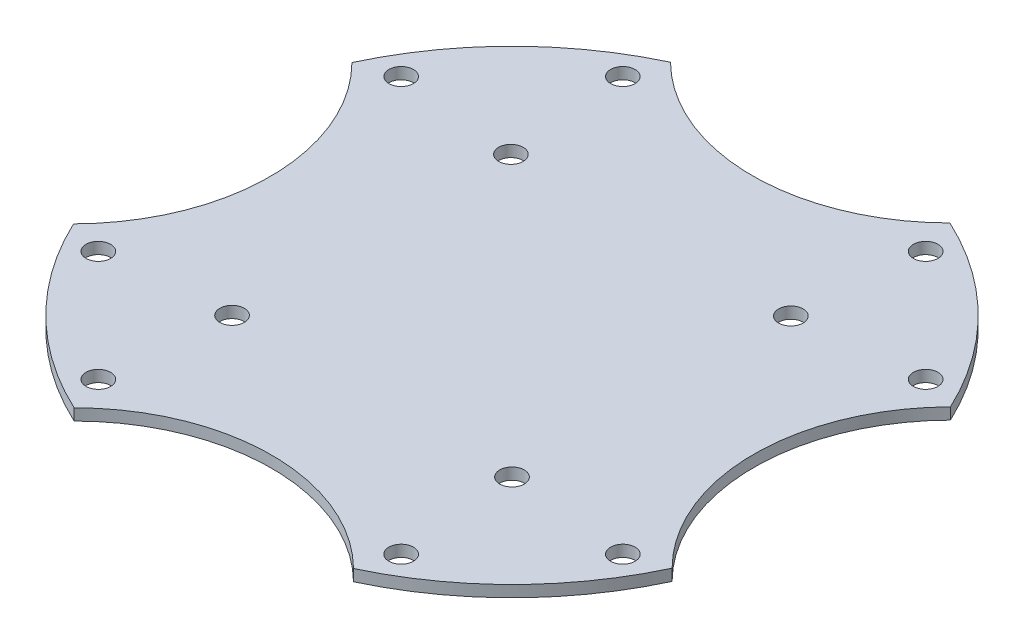
ISO-10303-21;
HEADER;
FILE_DESCRIPTION(('STEP AP214'),'2;1');
FILE_NAME('part.step','',(''),(''),'','','');
FILE_SCHEMA(('AUTOMOTIVE_DESIGN { 1 0 10303 214 1 1 1 1 }'));
ENDSEC;
DATA;
#1=APPLICATION_CONTEXT('core data for automotive mechanical design processes');
#2=APPLICATION_PROTOCOL_DEFINITION('international standard','automotive_design',2000,#1);
#3=PRODUCT_CONTEXT('',#1,'mechanical');
#4=PRODUCT('Part','Part','',(#3));
#5=PRODUCT_RELATED_PRODUCT_CATEGORY('part','',(#4));
#6=PRODUCT_DEFINITION_FORMATION('','',#4);
#7=PRODUCT_DEFINITION_CONTEXT('part definition',#1,'design');
#8=PRODUCT_DEFINITION('design','',#6,#7);
#9=PRODUCT_DEFINITION_SHAPE('','',#8);
#10=(LENGTH_UNIT() NAMED_UNIT(*) SI_UNIT(.MILLI.,.METRE.));
#11=(NAMED_UNIT(*) PLANE_ANGLE_UNIT() SI_UNIT($,.RADIAN.));
#12=(NAMED_UNIT(*) SI_UNIT($,.STERADIAN.) SOLID_ANGLE_UNIT());
#13=UNCERTAINTY_MEASURE_WITH_UNIT(LENGTH_MEASURE(1.E-05),#10,'distance_accuracy_value','');
#14=(GEOMETRIC_REPRESENTATION_CONTEXT(3) GLOBAL_UNCERTAINTY_ASSIGNED_CONTEXT((#13)) GLOBAL_UNIT_ASSIGNED_CONTEXT((#10,
#11,#12)) REPRESENTATION_CONTEXT('',''));
#15=CARTESIAN_POINT('',(0.,0.,0.));
#16=DIRECTION('',(0.,0.,1.));
#17=DIRECTION('',(1.,0.,0.));
#18=AXIS2_PLACEMENT_3D('',#15,#16,#17);
#19=CARTESIAN_POINT('',(-0.0519428007207684,1.5,-28.6088479159925));
#20=DIRECTION('',(0.,-1.,0.));
#21=DIRECTION('',(0.,0.,-1.));
#22=AXIS2_PLACEMENT_3D('',#19,#20,#21);
#23=PLANE('',#22);
#24=CARTESIAN_POINT('',(-18.2579356710307,1.5,18.2579356710318));
#25=DIRECTION('',(0.,1.,0.));
#26=DIRECTION('',(0.,0.,1.));
#27=AXIS2_PLACEMENT_3D('',#24,#25,#26);
#28=CIRCLE('',#27,1.6);
#29=CARTESIAN_POINT('',(-18.2579356710307,1.5,19.8579356710318));
#30=VERTEX_POINT('',#29);
#31=EDGE_CURVE('E242',#30,#30,#28,.T.);
#32=ORIENTED_EDGE('',*,*,#31,.F.);
#33=EDGE_LOOP('',(#32));
#34=FACE_BOUND('',#33,.T.);
#35=CARTESIAN_POINT('',(-18.2579356710307,1.5,-18.1164467806388));
#36=DIRECTION('',(0.,1.,0.));
#37=DIRECTION('',(0.,0.,1.));
#38=AXIS2_PLACEMENT_3D('',#35,#36,#37);
#39=CIRCLE('',#38,1.6);
#40=CARTESIAN_POINT('',(-18.2579356710307,1.5,-16.5164467806388));
#41=VERTEX_POINT('',#40);
#42=EDGE_CURVE('E230',#41,#41,#39,.T.);
#43=ORIENTED_EDGE('',*,*,#42,.F.);
#44=EDGE_LOOP('',(#43));
#45=FACE_BOUND('',#44,.T.);
#46=CARTESIAN_POINT('',(-34.2080034494857,1.5,-19.7499999999986));
#47=DIRECTION('',(0.,1.,0.));
#48=DIRECTION('',(0.,0.,1.));
#49=AXIS2_PLACEMENT_3D('',#46,#47,#48);
#50=CIRCLE('',#49,1.60000000000161);
#51=CARTESIAN_POINT('',(-34.2080034494857,1.5,-18.149999999997));
#52=VERTEX_POINT('',#51);
#53=EDGE_CURVE('E218',#52,#52,#50,.T.);
#54=ORIENTED_EDGE('',*,*,#53,.F.);
#55=EDGE_LOOP('',(#54));
#56=FACE_BOUND('',#55,.T.);
#57=CARTESIAN_POINT('',(-19.749999999999,1.5,34.2080034494872));
#58=DIRECTION('',(0.,1.,0.));
#59=DIRECTION('',(0.,0.,1.));
#60=AXIS2_PLACEMENT_3D('',#57,#58,#59);
#61=CIRCLE('',#60,1.60000000000069);
#62=CARTESIAN_POINT('',(-19.749999999999,1.5,35.8080034494878));
#63=VERTEX_POINT('',#62);
#64=EDGE_CURVE('E206',#63,#63,#61,.T.);
#65=ORIENTED_EDGE('',*,*,#64,.F.);
#66=EDGE_LOOP('',(#65));
#67=FACE_BOUND('',#66,.T.);
#68=CARTESIAN_POINT('',(34.2080034494868,1.5,19.7500000000005));
#69=DIRECTION('',(0.,1.,0.));
#70=DIRECTION('',(0.,0.,1.));
#71=AXIS2_PLACEMENT_3D('',#68,#69,#70);
#72=CIRCLE('',#71,1.59999999999926);
#73=CARTESIAN_POINT('',(34.2080034494868,1.5,21.3499999999998));
#74=VERTEX_POINT('',#73);
#75=EDGE_CURVE('E194',#74,#74,#72,.T.);
#76=ORIENTED_EDGE('',*,*,#75,.F.);
#77=EDGE_LOOP('',(#76));
#78=FACE_BOUND('',#77,.T.);
#79=CARTESIAN_POINT('',(19.7500000000001,1.5,-34.2080034494852));
#80=DIRECTION('',(0.,1.,0.));
#81=DIRECTION('',(0.,0.,1.));
#82=AXIS2_PLACEMENT_3D('',#79,#80,#81);
#83=CIRCLE('',#82,1.6);
#84=CARTESIAN_POINT('',(19.7500000000001,1.5,-32.6080034494852));
#85=VERTEX_POINT('',#84);
#86=EDGE_CURVE('E140',#85,#85,#83,.T.);
#87=ORIENTED_EDGE('',*,*,#86,.F.);
#88=EDGE_LOOP('',(#87));
#89=FACE_BOUND('',#88,.T.);
#90=CARTESIAN_POINT('',(-0.103885601441537,1.5,-57.2176958319849));
#91=DIRECTION('',(0.,-1.,0.));
#92=DIRECTION('',(0.,0.,-1.));
#93=AXIS2_PLACEMENT_3D('',#90,#91,#92);
#94=CIRCLE('',#93,25.7674411656824);
#95=CARTESIAN_POINT('',(18.1164467806406,1.5,-38.9973634499084));
#96=VERTEX_POINT('',#95);
#97=CARTESIAN_POINT('',(-18.2579356710304,1.5,-38.9313213882147));
#98=VERTEX_POINT('',#97);
#99=EDGE_CURVE('E151',#96,#98,#94,.T.);
#100=ORIENTED_EDGE('',*,*,#99,.T.);
#101=CARTESIAN_POINT('',(0.,1.5,0.));
#102=DIRECTION('',(0.,1.,0.));
#103=DIRECTION('',(0.,0.,1.));
#104=AXIS2_PLACEMENT_3D('',#101,#102,#103);
#105=CIRCLE('',#104,42.9999999999994);
#106=CARTESIAN_POINT('',(-38.997363449908,1.5,-18.1164467806391));
#107=VERTEX_POINT('',#106);
#108=EDGE_CURVE('E99',#98,#107,#105,.T.);
#109=ORIENTED_EDGE('',*,*,#108,.T.);
#110=CARTESIAN_POINT('',(-57.2176958319854,1.5,0.103885601442637));
#111=DIRECTION('',(0.,-1.,0.));
#112=DIRECTION('',(0.,0.,-1.));
#113=AXIS2_PLACEMENT_3D('',#110,#111,#112);
#114=CIRCLE('',#113,25.7674411656826);
#115=CARTESIAN_POINT('',(-38.9313213882156,1.5,18.2579356710319));
#116=VERTEX_POINT('',#115);
#117=EDGE_CURVE('E166',#107,#116,#114,.T.);
#118=ORIENTED_EDGE('',*,*,#117,.T.);
#119=CARTESIAN_POINT('',(0.,1.5,0.));
#120=DIRECTION('',(0.,1.,0.));
#121=DIRECTION('',(0.,0.,1.));
#122=AXIS2_PLACEMENT_3D('',#119,#120,#121);
#123=CIRCLE('',#122,43.0000000000004);
#124=CARTESIAN_POINT('',(-18.1164467806384,1.5,38.9973634499095));
#125=VERTEX_POINT('',#124);
#126=EDGE_CURVE('E179',#116,#125,#123,.T.);
#127=ORIENTED_EDGE('',*,*,#126,.T.);
#128=CARTESIAN_POINT('',(0.103885601442141,1.5,57.2176958319865));
#129=DIRECTION('',(0.,-1.,0.));
#130=DIRECTION('',(0.,0.,-1.));
#131=AXIS2_PLACEMENT_3D('',#128,#129,#130);
#132=CIRCLE('',#131,25.7674411656827);
#133=CARTESIAN_POINT('',(18.2579356710306,1.5,38.9313213882157));
#134=VERTEX_POINT('',#133);
#135=EDGE_CURVE('E118',#125,#134,#132,.T.);
#136=ORIENTED_EDGE('',*,*,#135,.T.);
#137=CARTESIAN_POINT('',(0.,1.5,0.));
#138=DIRECTION('',(0.,1.,0.));
#139=DIRECTION('',(0.,0.,1.));
#140=AXIS2_PLACEMENT_3D('',#137,#138,#139);
#141=CIRCLE('',#140,43.);
#142=CARTESIAN_POINT('',(38.997363449908,1.5,18.1164467806405));
#143=VERTEX_POINT('',#142);
#144=EDGE_CURVE('E112',#134,#143,#141,.T.);
#145=ORIENTED_EDGE('',*,*,#144,.T.);
#146=CARTESIAN_POINT('',(57.2176958319848,1.5,-0.103885601442804));
#147=DIRECTION('',(0.,-1.,0.));
#148=DIRECTION('',(0.,0.,-1.));
#149=AXIS2_PLACEMENT_3D('',#146,#147,#148);
#150=CIRCLE('',#149,25.7674411656818);
#151=CARTESIAN_POINT('',(38.9313213882152,1.5,-18.2579356710313));
#152=VERTEX_POINT('',#151);
#153=EDGE_CURVE('E116',#143,#152,#150,.T.);
#154=ORIENTED_EDGE('',*,*,#153,.T.);
#155=CARTESIAN_POINT('',(0.,1.5,0.));
#156=DIRECTION('',(0.,1.,0.));
#157=DIRECTION('',(0.,0.,1.));
#158=AXIS2_PLACEMENT_3D('',#155,#156,#157);
#159=CIRCLE('',#158,43.0000000000004);
#160=EDGE_CURVE('E56',#152,#96,#159,.T.);
#161=ORIENTED_EDGE('',*,*,#160,.T.);
#162=EDGE_LOOP('',(#100,#109,#118,#127,#136,#145,#154,#161));
#163=FACE_BOUND('',#162,.T.);
#164=CARTESIAN_POINT('',(34.2080034494854,1.5,-19.7499999999998));
#165=DIRECTION('',(0.,1.,0.));
#166=DIRECTION('',(0.,0.,1.));
#167=AXIS2_PLACEMENT_3D('',#164,#165,#166);
#168=CIRCLE('',#167,1.6);
#169=CARTESIAN_POINT('',(34.2080034494854,1.5,-18.1499999999998));
#170=VERTEX_POINT('',#169);
#171=EDGE_CURVE('E188',#170,#170,#168,.T.);
#172=ORIENTED_EDGE('',*,*,#171,.F.);
#173=EDGE_LOOP('',(#172));
#174=FACE_BOUND('',#173,.T.);
#175=CARTESIAN_POINT('',(19.7500000000013,1.5,34.2080034494858));
#176=DIRECTION('',(0.,1.,0.));
#177=DIRECTION('',(0.,0.,1.));
#178=AXIS2_PLACEMENT_3D('',#175,#176,#177);
#179=CIRCLE('',#178,1.59999999999921);
#180=CARTESIAN_POINT('',(19.7500000000013,1.5,35.808003449485));
#181=VERTEX_POINT('',#180);
#182=EDGE_CURVE('E200',#181,#181,#179,.T.);
#183=ORIENTED_EDGE('',*,*,#182,.F.);
#184=EDGE_LOOP('',(#183));
#185=FACE_BOUND('',#184,.T.);
#186=CARTESIAN_POINT('',(-34.2080034494843,1.5,19.7500000000017));
#187=DIRECTION('',(0.,1.,0.));
#188=DIRECTION('',(0.,0.,1.));
#189=AXIS2_PLACEMENT_3D('',#186,#187,#188);
#190=CIRCLE('',#189,1.60000000000056);
#191=CARTESIAN_POINT('',(-34.2080034494843,1.5,21.3500000000023));
#192=VERTEX_POINT('',#191);
#193=EDGE_CURVE('E212',#192,#192,#190,.T.);
#194=ORIENTED_EDGE('',*,*,#193,.F.);
#195=EDGE_LOOP('',(#194));
#196=FACE_BOUND('',#195,.T.);
#197=CARTESIAN_POINT('',(-19.7500000000002,1.5,-34.2080034494839));
#198=DIRECTION('',(0.,1.,0.));
#199=DIRECTION('',(0.,0.,1.));
#200=AXIS2_PLACEMENT_3D('',#197,#198,#199);
#201=CIRCLE('',#200,1.60000000000143);
#202=CARTESIAN_POINT('',(-19.7500000000002,1.5,-32.6080034494825));
#203=VERTEX_POINT('',#202);
#204=EDGE_CURVE('E224',#203,#203,#201,.T.);
#205=ORIENTED_EDGE('',*,*,#204,.F.);
#206=EDGE_LOOP('',(#205));
#207=FACE_BOUND('',#206,.T.);
#208=CARTESIAN_POINT('',(18.257935671031,1.5,-18.1164467806388));
#209=DIRECTION('',(0.,1.,0.));
#210=DIRECTION('',(0.,0.,1.));
#211=AXIS2_PLACEMENT_3D('',#208,#209,#210);
#212=CIRCLE('',#211,1.6);
#213=CARTESIAN_POINT('',(18.257935671031,1.5,-16.5164467806388));
#214=VERTEX_POINT('',#213);
#215=EDGE_CURVE('E236',#214,#214,#212,.T.);
#216=ORIENTED_EDGE('',*,*,#215,.F.);
#217=EDGE_LOOP('',(#216));
#218=FACE_BOUND('',#217,.T.);
#219=CARTESIAN_POINT('',(18.2579356710311,1.5,18.2579356710318));
#220=DIRECTION('',(0.,1.,0.));
#221=DIRECTION('',(0.,0.,1.));
#222=AXIS2_PLACEMENT_3D('',#219,#220,#221);
#223=CIRCLE('',#222,1.6);
#224=CARTESIAN_POINT('',(18.2579356710311,1.5,19.8579356710318));
#225=VERTEX_POINT('',#224);
#226=EDGE_CURVE('E248',#225,#225,#223,.T.);
#227=ORIENTED_EDGE('',*,*,#226,.F.);
#228=EDGE_LOOP('',(#227));
#229=FACE_BOUND('',#228,.T.);
#230=ADVANCED_FACE('F39',(#34,#45,#56,#67,#78,#89,#163,#174,#185,#196,#207,#218,#229),#23,.F.);
#231=CARTESIAN_POINT('',(-0.0519428007207684,0.,-28.6088479159925));
#232=DIRECTION('',(0.,-1.,0.));
#233=DIRECTION('',(0.,0.,-1.));
#234=AXIS2_PLACEMENT_3D('',#231,#232,#233);
#235=PLANE('',#234);
#236=CARTESIAN_POINT('',(-18.2579356710307,0.,18.2579356710318));
#237=DIRECTION('',(0.,1.,0.));
#238=DIRECTION('',(0.,0.,1.));
#239=AXIS2_PLACEMENT_3D('',#236,#237,#238);
#240=CIRCLE('',#239,1.6);
#241=CARTESIAN_POINT('',(-18.2579356710307,0.,19.8579356710318));
#242=VERTEX_POINT('',#241);
#243=EDGE_CURVE('E245',#242,#242,#240,.T.);
#244=ORIENTED_EDGE('',*,*,#243,.T.);
#245=EDGE_LOOP('',(#244));
#246=FACE_BOUND('',#245,.T.);
#247=CARTESIAN_POINT('',(-18.2579356710307,0.,-18.1164467806388));
#248=DIRECTION('',(0.,1.,0.));
#249=DIRECTION('',(0.,0.,1.));
#250=AXIS2_PLACEMENT_3D('',#247,#248,#249);
#251=CIRCLE('',#250,1.6);
#252=CARTESIAN_POINT('',(-18.2579356710307,0.,-16.5164467806388));
#253=VERTEX_POINT('',#252);
#254=EDGE_CURVE('E233',#253,#253,#251,.T.);
#255=ORIENTED_EDGE('',*,*,#254,.T.);
#256=EDGE_LOOP('',(#255));
#257=FACE_BOUND('',#256,.T.);
#258=CARTESIAN_POINT('',(-34.2080034494857,0.,-19.7499999999986));
#259=DIRECTION('',(0.,1.,0.));
#260=DIRECTION('',(0.,0.,1.));
#261=AXIS2_PLACEMENT_3D('',#258,#259,#260);
#262=CIRCLE('',#261,1.60000000000161);
#263=CARTESIAN_POINT('',(-34.2080034494857,0.,-18.149999999997));
#264=VERTEX_POINT('',#263);
#265=EDGE_CURVE('E221',#264,#264,#262,.T.);
#266=ORIENTED_EDGE('',*,*,#265,.T.);
#267=EDGE_LOOP('',(#266));
#268=FACE_BOUND('',#267,.T.);
#269=CARTESIAN_POINT('',(-19.749999999999,0.,34.2080034494872));
#270=DIRECTION('',(0.,1.,0.));
#271=DIRECTION('',(0.,0.,1.));
#272=AXIS2_PLACEMENT_3D('',#269,#270,#271);
#273=CIRCLE('',#272,1.60000000000069);
#274=CARTESIAN_POINT('',(-19.749999999999,0.,35.8080034494878));
#275=VERTEX_POINT('',#274);
#276=EDGE_CURVE('E209',#275,#275,#273,.T.);
#277=ORIENTED_EDGE('',*,*,#276,.T.);
#278=EDGE_LOOP('',(#277));
#279=FACE_BOUND('',#278,.T.);
#280=CARTESIAN_POINT('',(34.2080034494868,0.,19.7500000000005));
#281=DIRECTION('',(0.,1.,0.));
#282=DIRECTION('',(0.,0.,1.));
#283=AXIS2_PLACEMENT_3D('',#280,#281,#282);
#284=CIRCLE('',#283,1.59999999999926);
#285=CARTESIAN_POINT('',(34.2080034494868,0.,21.3499999999998));
#286=VERTEX_POINT('',#285);
#287=EDGE_CURVE('E197',#286,#286,#284,.T.);
#288=ORIENTED_EDGE('',*,*,#287,.T.);
#289=EDGE_LOOP('',(#288));
#290=FACE_BOUND('',#289,.T.);
#291=CARTESIAN_POINT('',(19.7500000000001,0.,-34.2080034494852));
#292=DIRECTION('',(0.,1.,0.));
#293=DIRECTION('',(0.,0.,1.));
#294=AXIS2_PLACEMENT_3D('',#291,#292,#293);
#295=CIRCLE('',#294,1.6);
#296=CARTESIAN_POINT('',(19.7500000000001,0.,-32.6080034494852));
#297=VERTEX_POINT('',#296);
#298=EDGE_CURVE('E185',#297,#297,#295,.T.);
#299=ORIENTED_EDGE('',*,*,#298,.T.);
#300=EDGE_LOOP('',(#299));
#301=FACE_BOUND('',#300,.T.);
#302=CARTESIAN_POINT('',(-0.103885601441537,0.,-57.2176958319849));
#303=DIRECTION('',(0.,-1.,0.));
#304=DIRECTION('',(0.,0.,-1.));
#305=AXIS2_PLACEMENT_3D('',#302,#303,#304);
#306=CIRCLE('',#305,25.7674411656824);
#307=CARTESIAN_POINT('',(18.1164467806406,0.,-38.9973634499084));
#308=VERTEX_POINT('',#307);
#309=CARTESIAN_POINT('',(-18.2579356710304,0.,-38.9313213882147));
#310=VERTEX_POINT('',#309);
#311=EDGE_CURVE('E136',#308,#310,#306,.T.);
#312=ORIENTED_EDGE('',*,*,#311,.F.);
#313=CARTESIAN_POINT('',(0.,0.,0.));
#314=DIRECTION('',(0.,1.,0.));
#315=DIRECTION('',(0.,0.,1.));
#316=AXIS2_PLACEMENT_3D('',#313,#314,#315);
#317=CIRCLE('',#316,43.0000000000004);
#318=CARTESIAN_POINT('',(38.9313213882152,0.,-18.2579356710313));
#319=VERTEX_POINT('',#318);
#320=EDGE_CURVE('E91',#319,#308,#317,.T.);
#321=ORIENTED_EDGE('',*,*,#320,.F.);
#322=CARTESIAN_POINT('',(57.2176958319848,0.,-0.103885601442804));
#323=DIRECTION('',(0.,-1.,0.));
#324=DIRECTION('',(0.,0.,-1.));
#325=AXIS2_PLACEMENT_3D('',#322,#323,#324);
#326=CIRCLE('',#325,25.7674411656818);
#327=CARTESIAN_POINT('',(38.997363449908,0.,18.1164467806405));
#328=VERTEX_POINT('',#327);
#329=EDGE_CURVE('E85',#328,#319,#326,.T.);
#330=ORIENTED_EDGE('',*,*,#329,.F.);
#331=CARTESIAN_POINT('',(0.,0.,0.));
#332=DIRECTION('',(0.,1.,0.));
#333=DIRECTION('',(0.,0.,1.));
#334=AXIS2_PLACEMENT_3D('',#331,#332,#333);
#335=CIRCLE('',#334,43.);
#336=CARTESIAN_POINT('',(18.2579356710306,0.,38.9313213882157));
#337=VERTEX_POINT('',#336);
#338=EDGE_CURVE('E126',#337,#328,#335,.T.);
#339=ORIENTED_EDGE('',*,*,#338,.F.);
#340=CARTESIAN_POINT('',(0.103885601442141,0.,57.2176958319865));
#341=DIRECTION('',(0.,-1.,0.));
#342=DIRECTION('',(0.,0.,-1.));
#343=AXIS2_PLACEMENT_3D('',#340,#341,#342);
#344=CIRCLE('',#343,25.7674411656827);
#345=CARTESIAN_POINT('',(-18.1164467806384,0.,38.9973634499095));
#346=VERTEX_POINT('',#345);
#347=EDGE_CURVE('E146',#346,#337,#344,.T.);
#348=ORIENTED_EDGE('',*,*,#347,.F.);
#349=CARTESIAN_POINT('',(0.,0.,0.));
#350=DIRECTION('',(0.,1.,0.));
#351=DIRECTION('',(0.,0.,1.));
#352=AXIS2_PLACEMENT_3D('',#349,#350,#351);
#353=CIRCLE('',#352,43.0000000000004);
#354=CARTESIAN_POINT('',(-38.9313213882156,0.,18.2579356710319));
#355=VERTEX_POINT('',#354);
#356=EDGE_CURVE('E144',#355,#346,#353,.T.);
#357=ORIENTED_EDGE('',*,*,#356,.F.);
#358=CARTESIAN_POINT('',(-57.2176958319854,0.,0.103885601442637));
#359=DIRECTION('',(0.,-1.,0.));
#360=DIRECTION('',(0.,0.,-1.));
#361=AXIS2_PLACEMENT_3D('',#358,#359,#360);
#362=CIRCLE('',#361,25.7674411656826);
#363=CARTESIAN_POINT('',(-38.997363449908,0.,-18.1164467806391));
#364=VERTEX_POINT('',#363);
#365=EDGE_CURVE('E142',#364,#355,#362,.T.);
#366=ORIENTED_EDGE('',*,*,#365,.F.);
#367=CARTESIAN_POINT('',(0.,0.,0.));
#368=DIRECTION('',(0.,1.,0.));
#369=DIRECTION('',(0.,0.,1.));
#370=AXIS2_PLACEMENT_3D('',#367,#368,#369);
#371=CIRCLE('',#370,42.9999999999994);
#372=EDGE_CURVE('E139',#310,#364,#371,.T.);
#373=ORIENTED_EDGE('',*,*,#372,.F.);
#374=EDGE_LOOP('',(#312,#321,#330,#339,#348,#357,#366,#373));
#375=FACE_BOUND('',#374,.T.);
#376=CARTESIAN_POINT('',(34.2080034494854,0.,-19.7499999999998));
#377=DIRECTION('',(0.,1.,0.));
#378=DIRECTION('',(0.,0.,1.));
#379=AXIS2_PLACEMENT_3D('',#376,#377,#378);
#380=CIRCLE('',#379,1.6);
#381=CARTESIAN_POINT('',(34.2080034494854,0.,-18.1499999999998));
#382=VERTEX_POINT('',#381);
#383=EDGE_CURVE('E191',#382,#382,#380,.T.);
#384=ORIENTED_EDGE('',*,*,#383,.T.);
#385=EDGE_LOOP('',(#384));
#386=FACE_BOUND('',#385,.T.);
#387=CARTESIAN_POINT('',(19.7500000000013,0.,34.2080034494858));
#388=DIRECTION('',(0.,1.,0.));
#389=DIRECTION('',(0.,0.,1.));
#390=AXIS2_PLACEMENT_3D('',#387,#388,#389);
#391=CIRCLE('',#390,1.59999999999921);
#392=CARTESIAN_POINT('',(19.7500000000013,0.,35.808003449485));
#393=VERTEX_POINT('',#392);
#394=EDGE_CURVE('E203',#393,#393,#391,.T.);
#395=ORIENTED_EDGE('',*,*,#394,.T.);
#396=EDGE_LOOP('',(#395));
#397=FACE_BOUND('',#396,.T.);
#398=CARTESIAN_POINT('',(-34.2080034494843,0.,19.7500000000017));
#399=DIRECTION('',(0.,1.,0.));
#400=DIRECTION('',(0.,0.,1.));
#401=AXIS2_PLACEMENT_3D('',#398,#399,#400);
#402=CIRCLE('',#401,1.60000000000056);
#403=CARTESIAN_POINT('',(-34.2080034494843,0.,21.3500000000023));
#404=VERTEX_POINT('',#403);
#405=EDGE_CURVE('E215',#404,#404,#402,.T.);
#406=ORIENTED_EDGE('',*,*,#405,.T.);
#407=EDGE_LOOP('',(#406));
#408=FACE_BOUND('',#407,.T.);
#409=CARTESIAN_POINT('',(-19.7500000000002,0.,-34.2080034494839));
#410=DIRECTION('',(0.,1.,0.));
#411=DIRECTION('',(0.,0.,1.));
#412=AXIS2_PLACEMENT_3D('',#409,#410,#411);
#413=CIRCLE('',#412,1.60000000000143);
#414=CARTESIAN_POINT('',(-19.7500000000002,0.,-32.6080034494825));
#415=VERTEX_POINT('',#414);
#416=EDGE_CURVE('E227',#415,#415,#413,.T.);
#417=ORIENTED_EDGE('',*,*,#416,.T.);
#418=EDGE_LOOP('',(#417));
#419=FACE_BOUND('',#418,.T.);
#420=CARTESIAN_POINT('',(18.257935671031,0.,-18.1164467806388));
#421=DIRECTION('',(0.,1.,0.));
#422=DIRECTION('',(0.,0.,1.));
#423=AXIS2_PLACEMENT_3D('',#420,#421,#422);
#424=CIRCLE('',#423,1.6);
#425=CARTESIAN_POINT('',(18.257935671031,0.,-16.5164467806388));
#426=VERTEX_POINT('',#425);
#427=EDGE_CURVE('E239',#426,#426,#424,.T.);
#428=ORIENTED_EDGE('',*,*,#427,.T.);
#429=EDGE_LOOP('',(#428));
#430=FACE_BOUND('',#429,.T.);
#431=CARTESIAN_POINT('',(18.2579356710311,0.,18.2579356710318));
#432=DIRECTION('',(0.,1.,0.));
#433=DIRECTION('',(0.,0.,1.));
#434=AXIS2_PLACEMENT_3D('',#431,#432,#433);
#435=CIRCLE('',#434,1.6);
#436=CARTESIAN_POINT('',(18.2579356710311,0.,19.8579356710318));
#437=VERTEX_POINT('',#436);
#438=EDGE_CURVE('E251',#437,#437,#435,.T.);
#439=ORIENTED_EDGE('',*,*,#438,.T.);
#440=EDGE_LOOP('',(#439));
#441=FACE_BOUND('',#440,.T.);
#442=ADVANCED_FACE('F170',(#246,#257,#268,#279,#290,#301,#375,#386,#397,#408,#419,#430,#441),
#235,.T.);
#443=CARTESIAN_POINT('',(-0.103885601441537,1.5,-57.2176958319849));
#444=DIRECTION('',(0.,-1.,0.));
#445=DIRECTION('',(0.,0.,-1.));
#446=AXIS2_PLACEMENT_3D('',#443,#444,#445);
#447=CYLINDRICAL_SURFACE('',#446,25.7674411656824);
#448=ORIENTED_EDGE('',*,*,#311,.T.);
#449=DIRECTION('',(0.,-1.,0.));
#450=VECTOR('',#449,1.);
#451=CARTESIAN_POINT('',(-18.2579356710304,1.5,-38.9313213882147));
#452=LINE('',#451,#450);
#453=EDGE_CURVE('E11',#98,#310,#452,.T.);
#454=ORIENTED_EDGE('',*,*,#453,.F.);
#455=ORIENTED_EDGE('',*,*,#99,.F.);
#456=DIRECTION('',(0.,-1.,0.));
#457=VECTOR('',#456,1.);
#458=CARTESIAN_POINT('',(18.1164467806406,1.5,-38.9973634499084));
#459=LINE('',#458,#457);
#460=EDGE_CURVE('E132',#96,#308,#459,.T.);
#461=ORIENTED_EDGE('',*,*,#460,.T.);
#462=EDGE_LOOP('',(#448,#454,#455,#461));
#463=FACE_BOUND('',#462,.T.);
#464=ADVANCED_FACE('F41',(#463),#447,.F.);
#465=CARTESIAN_POINT('',(0.,1.5,0.));
#466=DIRECTION('',(0.,-1.,0.));
#467=DIRECTION('',(0.,0.,-1.));
#468=AXIS2_PLACEMENT_3D('',#465,#466,#467);
#469=CYLINDRICAL_SURFACE('',#468,42.9999999999994);
#470=ORIENTED_EDGE('',*,*,#372,.T.);
#471=DIRECTION('',(0.,-1.,0.));
#472=VECTOR('',#471,1.);
#473=CARTESIAN_POINT('',(-38.997363449908,1.5,-18.1164467806391));
#474=LINE('',#473,#472);
#475=EDGE_CURVE('E48',#107,#364,#474,.T.);
#476=ORIENTED_EDGE('',*,*,#475,.F.);
#477=ORIENTED_EDGE('',*,*,#108,.F.);
#478=ORIENTED_EDGE('',*,*,#453,.T.);
#479=EDGE_LOOP('',(#470,#476,#477,#478));
#480=FACE_BOUND('',#479,.T.);
#481=ADVANCED_FACE('F286',(#480),#469,.T.);
#482=CARTESIAN_POINT('',(-57.2176958319854,1.5,0.103885601442637));
#483=DIRECTION('',(0.,-1.,0.));
#484=DIRECTION('',(0.,0.,-1.));
#485=AXIS2_PLACEMENT_3D('',#482,#483,#484);
#486=CYLINDRICAL_SURFACE('',#485,25.7674411656826);
#487=ORIENTED_EDGE('',*,*,#365,.T.);
#488=DIRECTION('',(0.,-1.,0.));
#489=VECTOR('',#488,1.);
#490=CARTESIAN_POINT('',(-38.9313213882156,1.5,18.2579356710319));
#491=LINE('',#490,#489);
#492=EDGE_CURVE('E158',#116,#355,#491,.T.);
#493=ORIENTED_EDGE('',*,*,#492,.F.);
#494=ORIENTED_EDGE('',*,*,#117,.F.);
#495=ORIENTED_EDGE('',*,*,#475,.T.);
#496=EDGE_LOOP('',(#487,#493,#494,#495));
#497=FACE_BOUND('',#496,.T.);
#498=ADVANCED_FACE('F164',(#497),#486,.F.);
#499=CARTESIAN_POINT('',(0.,1.5,0.));
#500=DIRECTION('',(0.,-1.,0.));
#501=DIRECTION('',(0.,0.,-1.));
#502=AXIS2_PLACEMENT_3D('',#499,#500,#501);
#503=CYLINDRICAL_SURFACE('',#502,43.0000000000004);
#504=ORIENTED_EDGE('',*,*,#356,.T.);
#505=DIRECTION('',(0.,-1.,0.));
#506=VECTOR('',#505,1.);
#507=CARTESIAN_POINT('',(-18.1164467806384,1.5,38.9973634499095));
#508=LINE('',#507,#506);
#509=EDGE_CURVE('E155',#125,#346,#508,.T.);
#510=ORIENTED_EDGE('',*,*,#509,.F.);
#511=ORIENTED_EDGE('',*,*,#126,.F.);
#512=ORIENTED_EDGE('',*,*,#492,.T.);
#513=EDGE_LOOP('',(#504,#510,#511,#512));
#514=FACE_BOUND('',#513,.T.);
#515=ADVANCED_FACE('F175',(#514),#503,.T.);
#516=CARTESIAN_POINT('',(0.103885601442141,1.5,57.2176958319865));
#517=DIRECTION('',(0.,-1.,0.));
#518=DIRECTION('',(0.,0.,-1.));
#519=AXIS2_PLACEMENT_3D('',#516,#517,#518);
#520=CYLINDRICAL_SURFACE('',#519,25.7674411656827);
#521=ORIENTED_EDGE('',*,*,#347,.T.);
#522=DIRECTION('',(0.,-1.,0.));
#523=VECTOR('',#522,1.);
#524=CARTESIAN_POINT('',(18.2579356710306,1.5,38.9313213882157));
#525=LINE('',#524,#523);
#526=EDGE_CURVE('E127',#134,#337,#525,.T.);
#527=ORIENTED_EDGE('',*,*,#526,.F.);
#528=ORIENTED_EDGE('',*,*,#135,.F.);
#529=ORIENTED_EDGE('',*,*,#509,.T.);
#530=EDGE_LOOP('',(#521,#527,#528,#529));
#531=FACE_BOUND('',#530,.T.);
#532=ADVANCED_FACE('F178',(#531),#520,.F.);
#533=CARTESIAN_POINT('',(0.,1.5,0.));
#534=DIRECTION('',(0.,-1.,0.));
#535=DIRECTION('',(0.,0.,-1.));
#536=AXIS2_PLACEMENT_3D('',#533,#534,#535);
#537=CYLINDRICAL_SURFACE('',#536,43.);
#538=ORIENTED_EDGE('',*,*,#338,.T.);
#539=DIRECTION('',(0.,-1.,0.));
#540=VECTOR('',#539,1.);
#541=CARTESIAN_POINT('',(38.997363449908,1.5,18.1164467806405));
#542=LINE('',#541,#540);
#543=EDGE_CURVE('E123',#143,#328,#542,.T.);
#544=ORIENTED_EDGE('',*,*,#543,.F.);
#545=ORIENTED_EDGE('',*,*,#144,.F.);
#546=ORIENTED_EDGE('',*,*,#526,.T.);
#547=EDGE_LOOP('',(#538,#544,#545,#546));
#548=FACE_BOUND('',#547,.T.);
#549=ADVANCED_FACE('F124',(#548),#537,.T.);
#550=CARTESIAN_POINT('',(57.2176958319848,1.5,-0.103885601442804));
#551=DIRECTION('',(0.,-1.,0.));
#552=DIRECTION('',(0.,0.,-1.));
#553=AXIS2_PLACEMENT_3D('',#550,#551,#552);
#554=CYLINDRICAL_SURFACE('',#553,25.7674411656818);
#555=ORIENTED_EDGE('',*,*,#329,.T.);
#556=DIRECTION('',(0.,-1.,0.));
#557=VECTOR('',#556,1.);
#558=CARTESIAN_POINT('',(38.9313213882152,1.5,-18.2579356710313));
#559=LINE('',#558,#557);
#560=EDGE_CURVE('E128',#152,#319,#559,.T.);
#561=ORIENTED_EDGE('',*,*,#560,.F.);
#562=ORIENTED_EDGE('',*,*,#153,.F.);
#563=ORIENTED_EDGE('',*,*,#543,.T.);
#564=EDGE_LOOP('',(#555,#561,#562,#563));
#565=FACE_BOUND('',#564,.T.);
#566=ADVANCED_FACE('F130',(#565),#554,.F.);
#567=CARTESIAN_POINT('',(0.,1.5,0.));
#568=DIRECTION('',(0.,-1.,0.));
#569=DIRECTION('',(0.,0.,-1.));
#570=AXIS2_PLACEMENT_3D('',#567,#568,#569);
#571=CYLINDRICAL_SURFACE('',#570,43.0000000000004);
#572=ORIENTED_EDGE('',*,*,#320,.T.);
#573=ORIENTED_EDGE('',*,*,#460,.F.);
#574=ORIENTED_EDGE('',*,*,#160,.F.);
#575=ORIENTED_EDGE('',*,*,#560,.T.);
#576=EDGE_LOOP('',(#572,#573,#574,#575));
#577=FACE_BOUND('',#576,.T.);
#578=ADVANCED_FACE('F274',(#577),#571,.T.);
#579=CARTESIAN_POINT('',(19.7500000000001,1.5,-34.2080034494852));
#580=DIRECTION('',(0.,-1.,0.));
#581=DIRECTION('',(0.,0.,-1.));
#582=AXIS2_PLACEMENT_3D('',#579,#580,#581);
#583=CYLINDRICAL_SURFACE('',#582,1.6);
#584=ORIENTED_EDGE('',*,*,#86,.T.);
#585=EDGE_LOOP('',(#584));
#586=FACE_BOUND('',#585,.T.);
#587=ORIENTED_EDGE('',*,*,#298,.F.);
#588=EDGE_LOOP('',(#587));
#589=FACE_BOUND('',#588,.T.);
#590=ADVANCED_FACE('F271',(#586,#589),#583,.F.);
#591=CARTESIAN_POINT('',(34.2080034494854,1.5,-19.7499999999998));
#592=DIRECTION('',(0.,-1.,0.));
#593=DIRECTION('',(0.,0.,-1.));
#594=AXIS2_PLACEMENT_3D('',#591,#592,#593);
#595=CYLINDRICAL_SURFACE('',#594,1.6);
#596=ORIENTED_EDGE('',*,*,#171,.T.);
#597=EDGE_LOOP('',(#596));
#598=FACE_BOUND('',#597,.T.);
#599=ORIENTED_EDGE('',*,*,#383,.F.);
#600=EDGE_LOOP('',(#599));
#601=FACE_BOUND('',#600,.T.);
#602=ADVANCED_FACE('F352',(#598,#601),#595,.F.);
#603=CARTESIAN_POINT('',(34.2080034494868,1.5,19.7500000000005));
#604=DIRECTION('',(0.,-1.,0.));
#605=DIRECTION('',(0.,0.,-1.));
#606=AXIS2_PLACEMENT_3D('',#603,#604,#605);
#607=CYLINDRICAL_SURFACE('',#606,1.59999999999926);
#608=ORIENTED_EDGE('',*,*,#75,.T.);
#609=EDGE_LOOP('',(#608));
#610=FACE_BOUND('',#609,.T.);
#611=ORIENTED_EDGE('',*,*,#287,.F.);
#612=EDGE_LOOP('',(#611));
#613=FACE_BOUND('',#612,.T.);
#614=ADVANCED_FACE('F360',(#610,#613),#607,.F.);
#615=CARTESIAN_POINT('',(19.7500000000013,1.5,34.2080034494858));
#616=DIRECTION('',(0.,-1.,0.));
#617=DIRECTION('',(0.,0.,-1.));
#618=AXIS2_PLACEMENT_3D('',#615,#616,#617);
#619=CYLINDRICAL_SURFACE('',#618,1.59999999999921);
#620=ORIENTED_EDGE('',*,*,#182,.T.);
#621=EDGE_LOOP('',(#620));
#622=FACE_BOUND('',#621,.T.);
#623=ORIENTED_EDGE('',*,*,#394,.F.);
#624=EDGE_LOOP('',(#623));
#625=FACE_BOUND('',#624,.T.);
#626=ADVANCED_FACE('F368',(#622,#625),#619,.F.);
#627=CARTESIAN_POINT('',(-19.749999999999,1.5,34.2080034494872));
#628=DIRECTION('',(0.,-1.,0.));
#629=DIRECTION('',(0.,0.,-1.));
#630=AXIS2_PLACEMENT_3D('',#627,#628,#629);
#631=CYLINDRICAL_SURFACE('',#630,1.60000000000069);
#632=ORIENTED_EDGE('',*,*,#64,.T.);
#633=EDGE_LOOP('',(#632));
#634=FACE_BOUND('',#633,.T.);
#635=ORIENTED_EDGE('',*,*,#276,.F.);
#636=EDGE_LOOP('',(#635));
#637=FACE_BOUND('',#636,.T.);
#638=ADVANCED_FACE('F377',(#634,#637),#631,.F.);
#639=CARTESIAN_POINT('',(-34.2080034494843,1.5,19.7500000000017));
#640=DIRECTION('',(0.,-1.,0.));
#641=DIRECTION('',(0.,0.,-1.));
#642=AXIS2_PLACEMENT_3D('',#639,#640,#641);
#643=CYLINDRICAL_SURFACE('',#642,1.60000000000056);
#644=ORIENTED_EDGE('',*,*,#193,.T.);
#645=EDGE_LOOP('',(#644));
#646=FACE_BOUND('',#645,.T.);
#647=ORIENTED_EDGE('',*,*,#405,.F.);
#648=EDGE_LOOP('',(#647));
#649=FACE_BOUND('',#648,.T.);
#650=ADVANCED_FACE('F386',(#646,#649),#643,.F.);
#651=CARTESIAN_POINT('',(-34.2080034494857,1.5,-19.7499999999986));
#652=DIRECTION('',(0.,-1.,0.));
#653=DIRECTION('',(0.,0.,-1.));
#654=AXIS2_PLACEMENT_3D('',#651,#652,#653);
#655=CYLINDRICAL_SURFACE('',#654,1.60000000000161);
#656=ORIENTED_EDGE('',*,*,#53,.T.);
#657=EDGE_LOOP('',(#656));
#658=FACE_BOUND('',#657,.T.);
#659=ORIENTED_EDGE('',*,*,#265,.F.);
#660=EDGE_LOOP('',(#659));
#661=FACE_BOUND('',#660,.T.);
#662=ADVANCED_FACE('F395',(#658,#661),#655,.F.);
#663=CARTESIAN_POINT('',(-19.7500000000002,1.5,-34.2080034494839));
#664=DIRECTION('',(0.,-1.,0.));
#665=DIRECTION('',(0.,0.,-1.));
#666=AXIS2_PLACEMENT_3D('',#663,#664,#665);
#667=CYLINDRICAL_SURFACE('',#666,1.60000000000143);
#668=ORIENTED_EDGE('',*,*,#204,.T.);
#669=EDGE_LOOP('',(#668));
#670=FACE_BOUND('',#669,.T.);
#671=ORIENTED_EDGE('',*,*,#416,.F.);
#672=EDGE_LOOP('',(#671));
#673=FACE_BOUND('',#672,.T.);
#674=ADVANCED_FACE('F404',(#670,#673),#667,.F.);
#675=CARTESIAN_POINT('',(-18.2579356710307,1.5,-18.1164467806388));
#676=DIRECTION('',(0.,-1.,0.));
#677=DIRECTION('',(0.,0.,-1.));
#678=AXIS2_PLACEMENT_3D('',#675,#676,#677);
#679=CYLINDRICAL_SURFACE('',#678,1.6);
#680=ORIENTED_EDGE('',*,*,#42,.T.);
#681=EDGE_LOOP('',(#680));
#682=FACE_BOUND('',#681,.T.);
#683=ORIENTED_EDGE('',*,*,#254,.F.);
#684=EDGE_LOOP('',(#683));
#685=FACE_BOUND('',#684,.T.);
#686=ADVANCED_FACE('F413',(#682,#685),#679,.F.);
#687=CARTESIAN_POINT('',(18.257935671031,1.5,-18.1164467806388));
#688=DIRECTION('',(0.,-1.,0.));
#689=DIRECTION('',(0.,0.,-1.));
#690=AXIS2_PLACEMENT_3D('',#687,#688,#689);
#691=CYLINDRICAL_SURFACE('',#690,1.6);
#692=ORIENTED_EDGE('',*,*,#215,.T.);
#693=EDGE_LOOP('',(#692));
#694=FACE_BOUND('',#693,.T.);
#695=ORIENTED_EDGE('',*,*,#427,.F.);
#696=EDGE_LOOP('',(#695));
#697=FACE_BOUND('',#696,.T.);
#698=ADVANCED_FACE('F422',(#694,#697),#691,.F.);
#699=CARTESIAN_POINT('',(-18.2579356710307,1.5,18.2579356710318));
#700=DIRECTION('',(0.,-1.,0.));
#701=DIRECTION('',(0.,0.,-1.));
#702=AXIS2_PLACEMENT_3D('',#699,#700,#701);
#703=CYLINDRICAL_SURFACE('',#702,1.6);
#704=ORIENTED_EDGE('',*,*,#31,.T.);
#705=EDGE_LOOP('',(#704));
#706=FACE_BOUND('',#705,.T.);
#707=ORIENTED_EDGE('',*,*,#243,.F.);
#708=EDGE_LOOP('',(#707));
#709=FACE_BOUND('',#708,.T.);
#710=ADVANCED_FACE('F431',(#706,#709),#703,.F.);
#711=CARTESIAN_POINT('',(18.2579356710311,1.5,18.2579356710318));
#712=DIRECTION('',(0.,-1.,0.));
#713=DIRECTION('',(0.,0.,-1.));
#714=AXIS2_PLACEMENT_3D('',#711,#712,#713);
#715=CYLINDRICAL_SURFACE('',#714,1.6);
#716=ORIENTED_EDGE('',*,*,#226,.T.);
#717=EDGE_LOOP('',(#716));
#718=FACE_BOUND('',#717,.T.);
#719=ORIENTED_EDGE('',*,*,#438,.F.);
#720=EDGE_LOOP('',(#719));
#721=FACE_BOUND('',#720,.T.);
#722=ADVANCED_FACE('F257',(#718,#721),#715,.F.);
#723=CLOSED_SHELL('',(#230,#442,#464,#481,#498,#515,#532,#549,#566,#578,#590,#602,#614,#626,
#638,#650,#662,#674,#686,#698,#710,#722));
#724=MANIFOLD_SOLID_BREP('B2',#723);
#725=ADVANCED_BREP_SHAPE_REPRESENTATION('',(#18,#724),#14);
#726=SHAPE_DEFINITION_REPRESENTATION(#9,#725);
ENDSEC;
END-ISO-10303-21;
